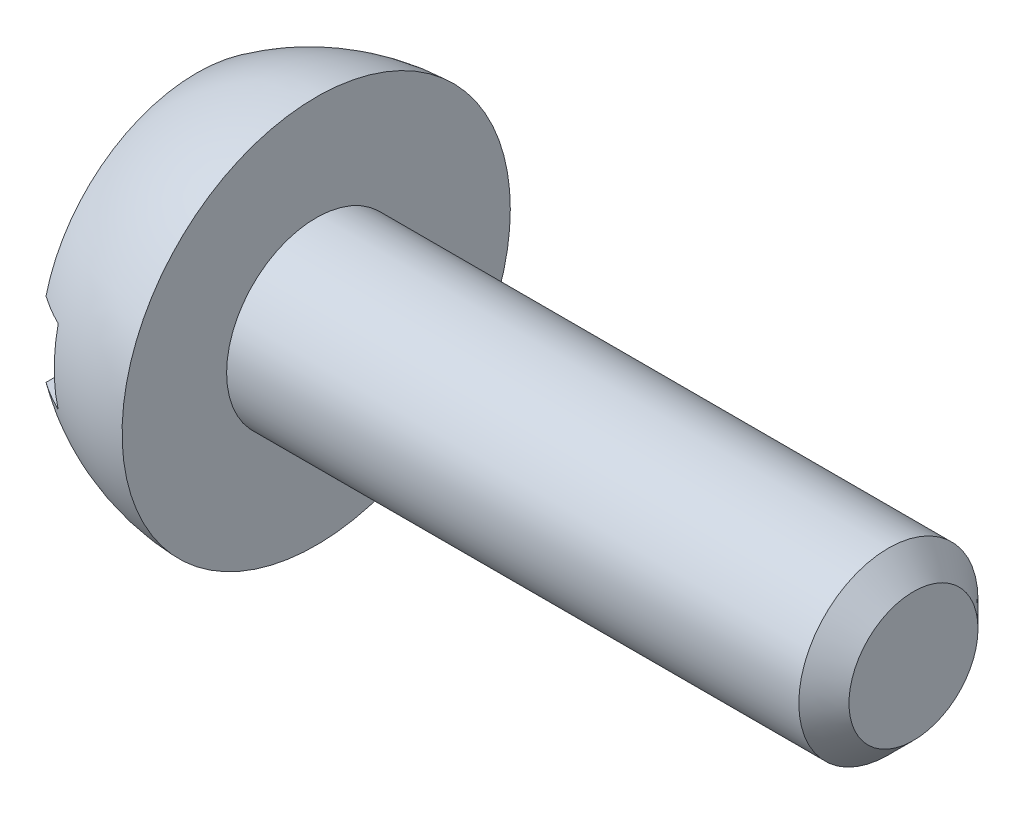
ISO-10303-21;
HEADER;
FILE_DESCRIPTION(('STEP AP214'),'2;1');
FILE_NAME('part.step','',(''),(''),'','','');
FILE_SCHEMA(('AUTOMOTIVE_DESIGN { 1 0 10303 214 1 1 1 1 }'));
ENDSEC;
DATA;
#1=APPLICATION_CONTEXT('core data for automotive mechanical design processes');
#2=APPLICATION_PROTOCOL_DEFINITION('international standard','automotive_design',2000,#1);
#3=PRODUCT_CONTEXT('',#1,'mechanical');
#4=PRODUCT('Part','Part','',(#3));
#5=PRODUCT_RELATED_PRODUCT_CATEGORY('part','',(#4));
#6=PRODUCT_DEFINITION_FORMATION('','',#4);
#7=PRODUCT_DEFINITION_CONTEXT('part definition',#1,'design');
#8=PRODUCT_DEFINITION('design','',#6,#7);
#9=PRODUCT_DEFINITION_SHAPE('','',#8);
#10=(LENGTH_UNIT() NAMED_UNIT(*) SI_UNIT(.MILLI.,.METRE.));
#11=(NAMED_UNIT(*) PLANE_ANGLE_UNIT() SI_UNIT($,.RADIAN.));
#12=(NAMED_UNIT(*) SI_UNIT($,.STERADIAN.) SOLID_ANGLE_UNIT());
#13=UNCERTAINTY_MEASURE_WITH_UNIT(LENGTH_MEASURE(1.E-05),#10,'distance_accuracy_value','');
#14=(GEOMETRIC_REPRESENTATION_CONTEXT(3) GLOBAL_UNCERTAINTY_ASSIGNED_CONTEXT((#13)) GLOBAL_UNIT_ASSIGNED_CONTEXT((#10,
#11,#12)) REPRESENTATION_CONTEXT('',''));
#15=CARTESIAN_POINT('',(0.,0.,0.));
#16=DIRECTION('',(0.,0.,1.));
#17=DIRECTION('',(1.,0.,0.));
#18=AXIS2_PLACEMENT_3D('',#15,#16,#17);
#19=CARTESIAN_POINT('',(0.0225151400772453,0.,0.));
#20=DIRECTION('',(1.,0.,0.));
#21=DIRECTION('',(0.,0.,-1.));
#22=AXIS2_PLACEMENT_3D('',#19,#20,#21);
#23=DEGENERATE_TOROIDAL_SURFACE('',#22,0.0996619694684413,0.750000000000001,.F.);
#24=CARTESIAN_POINT('',(0.,0.,0.));
#25=DIRECTION('',(1.,0.,0.));
#26=DIRECTION('',(0.,0.,-1.));
#27=AXIS2_PLACEMENT_3D('',#24,#25,#26);
#28=CIRCLE('',#27,0.65);
#29=CARTESIAN_POINT('',(0.,0.,-0.65));
#30=VERTEX_POINT('',#29);
#31=EDGE_CURVE('E142',#30,#30,#28,.F.);
#32=ORIENTED_EDGE('',*,*,#31,.T.);
#33=EDGE_LOOP('',(#32));
#34=FACE_BOUND('',#33,.T.);
#35=CARTESIAN_POINT('',(-0.3,0.,0.));
#36=DIRECTION('',(1.,0.,0.));
#37=DIRECTION('',(0.,0.,-1.));
#38=AXIS2_PLACEMENT_3D('',#35,#36,#37);
#39=CIRCLE('',#38,0.577452484978483);
#40=CARTESIAN_POINT('',(-0.3,0.125,0.563760917772619));
#41=VERTEX_POINT('',#40);
#42=CARTESIAN_POINT('',(-0.3,-0.125,0.563760917772619));
#43=VERTEX_POINT('',#42);
#44=EDGE_CURVE('E110',#41,#43,#39,.T.);
#45=ORIENTED_EDGE('',*,*,#44,.T.);
#46=CARTESIAN_POINT('',(-0.3,-0.125,0.563760917772619));
#47=CARTESIAN_POINT('',(-0.304631080707557,-0.124999998211668,0.561501534707431));
#48=CARTESIAN_POINT('',(-0.309238373809965,-0.124999999619542,0.559193396977852));
#49=CARTESIAN_POINT('',(-0.31832452412634,-0.125000009172219,0.554521172330793));
#50=CARTESIAN_POINT('',(-0.322804227402496,-0.125000017200727,0.552158730639608));
#51=CARTESIAN_POINT('',(-0.331635870182839,-0.125000040049112,0.547383755265721));
#52=CARTESIAN_POINT('',(-0.335988673995928,-0.125000054747768,0.544972820077659));
#53=CARTESIAN_POINT('',(-0.344567361991802,-0.125000082970635,0.540106572392637));
#54=CARTESIAN_POINT('',(-0.348794126591955,-0.125000096511087,0.53765281187659));
#55=CARTESIAN_POINT('',(-0.357121734225697,-0.125000114226031,0.532706468770877));
#56=CARTESIAN_POINT('',(-0.361223471828923,-0.125000118565574,0.530215392173125));
#57=CARTESIAN_POINT('',(-0.369302168361253,-0.125000113414877,0.525199815020613));
#58=CARTESIAN_POINT('',(-0.373280034087809,-0.125000104177869,0.522676774972304));
#59=CARTESIAN_POINT('',(-0.381112262195754,-0.125000073829636,0.517602507456649));
#60=CARTESIAN_POINT('',(-0.3849675417739,-0.125000052944311,0.515052695617535));
#61=CARTESIAN_POINT('',(-0.392555998788748,-0.125000017656831,0.50992996583906));
#62=CARTESIAN_POINT('',(-0.396290101986044,-0.125000003138479,0.507358419163328));
#63=CARTESIAN_POINT('',(-0.399999999999998,-0.124999999999999,0.50475241455589));
#64=B_SPLINE_CURVE_WITH_KNOTS('',3,(#46,#47,#48,#49,#50,#51,#52,#53,#54,#55,#56,#57,#58,#59,#60,
#61,#62,#63),.UNSPECIFIED.,.F.,.F.,(4,2,2,2,2,2,2,2,4),(0.,0.0154582186616745,
0.0306505490189183,0.0455771981912502,0.0602383612324944,0.0746342220186075,0.0887649543050084,
0.102630722949918,0.116231685301101),.UNSPECIFIED.);
#65=CARTESIAN_POINT('',(-0.399999999999999,-0.125,0.504752414555891));
#66=VERTEX_POINT('',#65);
#67=EDGE_CURVE('E100',#43,#66,#64,.T.);
#68=ORIENTED_EDGE('',*,*,#67,.T.);
#69=CARTESIAN_POINT('',(-0.399999999999998,0.,0.));
#70=DIRECTION('',(1.,0.,0.));
#71=DIRECTION('',(0.,0.,-1.));
#72=AXIS2_PLACEMENT_3D('',#69,#70,#71);
#73=CIRCLE('',#72,0.520000000000001);
#74=CARTESIAN_POINT('',(-0.399999999999999,-0.125,-0.504752414555889));
#75=VERTEX_POINT('',#74);
#76=EDGE_CURVE('E87',#66,#75,#73,.T.);
#77=ORIENTED_EDGE('',*,*,#76,.T.);
#78=CARTESIAN_POINT('',(-0.4,-0.125,-0.504752414555889));
#79=CARTESIAN_POINT('',(-0.396290101985752,-0.12500000313848,-0.507358419163533));
#80=CARTESIAN_POINT('',(-0.392555998788159,-0.125000017656829,-0.509929965839466));
#81=CARTESIAN_POINT('',(-0.384967541772794,-0.125000052944299,-0.515052695618276));
#82=CARTESIAN_POINT('',(-0.381112262194431,-0.125000073829618,-0.517602507457524));
#83=CARTESIAN_POINT('',(-0.37328003408613,-0.125000104177836,-0.522676774973386));
#84=CARTESIAN_POINT('',(-0.369302168359438,-0.125000113414836,-0.525199815021767));
#85=CARTESIAN_POINT('',(-0.361223471826919,-0.125000118565517,-0.530215392174365));
#86=CARTESIAN_POINT('',(-0.357121734223642,-0.125000114225967,-0.532706468772132));
#87=CARTESIAN_POINT('',(-0.348794126589884,-0.12500009651101,-0.537652811877819));
#88=CARTESIAN_POINT('',(-0.344567361989768,-0.125000082970555,-0.540106572393828));
#89=CARTESIAN_POINT('',(-0.335988673994057,-0.125000054747683,-0.544972820078722));
#90=CARTESIAN_POINT('',(-0.331635870181095,-0.125000040049028,-0.547383755266697));
#91=CARTESIAN_POINT('',(-0.3228042274011,-0.125000017200653,-0.552158730640365));
#92=CARTESIAN_POINT('',(-0.318324524125165,-0.125000009172153,-0.55452117233142));
#93=CARTESIAN_POINT('',(-0.309238373809328,-0.124999999619503,-0.55919339697818));
#94=CARTESIAN_POINT('',(-0.304631080707237,-0.124999998211647,-0.561501534707592));
#95=CARTESIAN_POINT('',(-0.3,-0.125,-0.563760917772618));
#96=B_SPLINE_CURVE_WITH_KNOTS('',3,(#78,#79,#80,#81,#82,#83,#84,#85,#86,#87,#88,#89,#90,#91,#92,
#93,#94,#95),.UNSPECIFIED.,.F.,.F.,(4,2,2,2,2,2,2,2,4),(0.,0.0136009623522593,
0.0274667309979378,0.0415974632848006,0.0559933240710683,0.0706544871121593,0.0855811362840305,
0.100773466640506,0.116231685301105),.UNSPECIFIED.);
#97=CARTESIAN_POINT('',(-0.3,-0.125,-0.563760917772618));
#98=VERTEX_POINT('',#97);
#99=EDGE_CURVE('E58',#75,#98,#96,.T.);
#100=ORIENTED_EDGE('',*,*,#99,.T.);
#101=CARTESIAN_POINT('',(-0.300000000000031,0.125000000000014,-0.5637609177726));
#102=VERTEX_POINT('',#101);
#103=EDGE_CURVE('E97',#98,#102,#39,.T.);
#104=ORIENTED_EDGE('',*,*,#103,.T.);
#105=CARTESIAN_POINT('',(-0.300000000000062,0.125000000000028,-0.563760917772582));
#106=CARTESIAN_POINT('',(-0.304631080707548,0.12499999821169,-0.561501534707431));
#107=CARTESIAN_POINT('',(-0.309238373809885,0.124999999619557,-0.559193396977889));
#108=CARTESIAN_POINT('',(-0.318324524126139,0.125000009172224,-0.554521172330897));
#109=CARTESIAN_POINT('',(-0.322804227402244,0.125000017200727,-0.552158730639741));
#110=CARTESIAN_POINT('',(-0.331635870182507,0.125000040049107,-0.547383755265905));
#111=CARTESIAN_POINT('',(-0.335988673995566,0.125000054747761,-0.544972820077863));
#112=CARTESIAN_POINT('',(-0.3445673619914,0.125000082970626,-0.540106572392871));
#113=CARTESIAN_POINT('',(-0.348794126591542,0.125000096511077,-0.537652811876833));
#114=CARTESIAN_POINT('',(-0.357121734225283,0.125000114226022,-0.532706468771129));
#115=CARTESIAN_POINT('',(-0.361223471828517,0.125000118565565,-0.530215392173376));
#116=CARTESIAN_POINT('',(-0.369302168360883,0.12500011341487,-0.525199815020848));
#117=CARTESIAN_POINT('',(-0.373280034087466,0.125000104177863,-0.522676774972525));
#118=CARTESIAN_POINT('',(-0.381112262195483,0.125000073829633,-0.517602507456828));
#119=CARTESIAN_POINT('',(-0.384967541773673,0.125000052944309,-0.515052695617687));
#120=CARTESIAN_POINT('',(-0.392555998788627,0.12500001765683,-0.509929965839143));
#121=CARTESIAN_POINT('',(-0.396290101985985,0.125000003138479,-0.507358419163369));
#122=CARTESIAN_POINT('',(-0.4,0.125,-0.504752414555889));
#123=B_SPLINE_CURVE_WITH_KNOTS('',3,(#105,#106,#107,#108,#109,#110,#111,#112,#113,#114,#115,
#116,#117,#118,#119,#120,#121,#122),.UNSPECIFIED.,.F.,.F.,(4,2,2,2,2,2,2,2,4),(0.,
0.0154582186614339,0.0306505490185034,0.0455771981907271,0.0602383612319295,0.0746342220180672,
0.0887649543045586,0.102630722949625,0.116231685301031),.UNSPECIFIED.);
#124=CARTESIAN_POINT('',(-0.4,0.125,-0.504752414555889));
#125=VERTEX_POINT('',#124);
#126=EDGE_CURVE('E136',#102,#125,#123,.T.);
#127=ORIENTED_EDGE('',*,*,#126,.T.);
#128=CARTESIAN_POINT('',(-0.4,0.,0.));
#129=DIRECTION('',(1.,0.,0.));
#130=DIRECTION('',(0.,0.,-1.));
#131=AXIS2_PLACEMENT_3D('',#128,#129,#130);
#132=CIRCLE('',#131,0.52);
#133=CARTESIAN_POINT('',(-0.4,0.125,0.504752414555889));
#134=VERTEX_POINT('',#133);
#135=EDGE_CURVE('E141',#125,#134,#132,.T.);
#136=ORIENTED_EDGE('',*,*,#135,.T.);
#137=CARTESIAN_POINT('',(-0.4,0.125,0.504752414555889));
#138=CARTESIAN_POINT('',(-0.396290101985752,0.12500000313848,0.507358419163533));
#139=CARTESIAN_POINT('',(-0.392555998788159,0.125000017656829,0.509929965839466));
#140=CARTESIAN_POINT('',(-0.384967541772795,0.125000052944299,0.515052695618275));
#141=CARTESIAN_POINT('',(-0.381112262194431,0.125000073829618,0.517602507457524));
#142=CARTESIAN_POINT('',(-0.37328003408613,0.125000104177836,0.522676774973386));
#143=CARTESIAN_POINT('',(-0.369302168359438,0.125000113414836,0.525199815021767));
#144=CARTESIAN_POINT('',(-0.361223471826919,0.125000118565517,0.530215392174365));
#145=CARTESIAN_POINT('',(-0.357121734223642,0.125000114225967,0.532706468772131));
#146=CARTESIAN_POINT('',(-0.348794126589884,0.12500009651101,0.537652811877819));
#147=CARTESIAN_POINT('',(-0.344567361989768,0.125000082970555,0.540106572393828));
#148=CARTESIAN_POINT('',(-0.335988673994057,0.125000054747683,0.544972820078722));
#149=CARTESIAN_POINT('',(-0.331635870181095,0.125000040049029,0.547383755266697));
#150=CARTESIAN_POINT('',(-0.3228042274011,0.125000017200652,0.552158730640365));
#151=CARTESIAN_POINT('',(-0.318324524125165,0.125000009172153,0.554521172331421));
#152=CARTESIAN_POINT('',(-0.309238373809328,0.124999999619502,0.55919339697818));
#153=CARTESIAN_POINT('',(-0.304631080707237,0.124999998211645,0.561501534707593));
#154=CARTESIAN_POINT('',(-0.3,0.125,0.563760917772618));
#155=B_SPLINE_CURVE_WITH_KNOTS('',3,(#137,#138,#139,#140,#141,#142,#143,#144,#145,#146,#147,
#148,#149,#150,#151,#152,#153,#154),.UNSPECIFIED.,.F.,.F.,(4,2,2,2,2,2,2,2,4),(0.,
0.0136009623522592,0.0274667309979378,0.0415974632848005,0.0559933240710683,0.0706544871121594,
0.0855811362840305,0.100773466640506,0.116231685301105),.UNSPECIFIED.);
#156=EDGE_CURVE('E66',#134,#41,#155,.T.);
#157=ORIENTED_EDGE('',*,*,#156,.T.);
#158=EDGE_LOOP('',(#45,#68,#77,#100,#104,#127,#136,#157));
#159=FACE_BOUND('',#158,.T.);
#160=ADVANCED_FACE('F44',(#34,#159),#23,.F.);
#161=CARTESIAN_POINT('',(-0.4,0.,0.));
#162=DIRECTION('',(1.,0.,0.));
#163=DIRECTION('',(0.,0.,-1.));
#164=AXIS2_PLACEMENT_3D('',#161,#162,#163);
#165=PLANE('',#164);
#166=DIRECTION('',(0.,0.,-1.));
#167=VECTOR('',#166,1.);
#168=CARTESIAN_POINT('',(-0.4,0.125,1.3));
#169=LINE('',#168,#167);
#170=EDGE_CURVE('E121',#134,#125,#169,.T.);
#171=ORIENTED_EDGE('',*,*,#170,.F.);
#172=ORIENTED_EDGE('',*,*,#135,.F.);
#173=EDGE_LOOP('',(#171,#172));
#174=FACE_BOUND('',#173,.T.);
#175=ADVANCED_FACE('F189',(#174),#165,.F.);
#176=CARTESIAN_POINT('',(0.,0.65,0.));
#177=DIRECTION('',(-1.,0.,0.));
#178=DIRECTION('',(0.,0.,1.));
#179=AXIS2_PLACEMENT_3D('',#176,#177,#178);
#180=PLANE('',#179);
#181=CARTESIAN_POINT('',(0.,0.,0.));
#182=DIRECTION('',(-1.,0.,0.));
#183=DIRECTION('',(0.,0.,1.));
#184=AXIS2_PLACEMENT_3D('',#181,#182,#183);
#185=CIRCLE('',#184,0.3);
#186=CARTESIAN_POINT('',(0.,0.,0.3));
#187=VERTEX_POINT('',#186);
#188=EDGE_CURVE('E151',#187,#187,#185,.F.);
#189=ORIENTED_EDGE('',*,*,#188,.F.);
#190=EDGE_LOOP('',(#189));
#191=FACE_BOUND('',#190,.T.);
#192=ORIENTED_EDGE('',*,*,#31,.F.);
#193=EDGE_LOOP('',(#192));
#194=FACE_BOUND('',#193,.T.);
#195=ADVANCED_FACE('F133',(#191,#194),#180,.F.);
#196=CARTESIAN_POINT('',(-0.3,0.125,1.3));
#197=DIRECTION('',(0.,-1.,0.));
#198=DIRECTION('',(0.,0.,-1.));
#199=AXIS2_PLACEMENT_3D('',#196,#197,#198);
#200=PLANE('',#199);
#201=DIRECTION('',(0.,0.,1.));
#202=VECTOR('',#201,1.);
#203=CARTESIAN_POINT('',(-0.3,0.125,1.3));
#204=LINE('',#203,#202);
#205=EDGE_CURVE('E113',#41,#102,#204,.F.);
#206=ORIENTED_EDGE('',*,*,#205,.F.);
#207=ORIENTED_EDGE('',*,*,#156,.F.);
#208=ORIENTED_EDGE('',*,*,#170,.T.);
#209=ORIENTED_EDGE('',*,*,#126,.F.);
#210=EDGE_LOOP('',(#206,#207,#208,#209));
#211=FACE_BOUND('',#210,.T.);
#212=ADVANCED_FACE('F131',(#211),#200,.T.);
#213=CARTESIAN_POINT('',(-0.3,-0.125,1.3));
#214=DIRECTION('',(-1.,0.,0.));
#215=DIRECTION('',(0.,0.,1.));
#216=AXIS2_PLACEMENT_3D('',#213,#214,#215);
#217=PLANE('',#216);
#218=DIRECTION('',(0.,0.,1.));
#219=VECTOR('',#218,1.);
#220=CARTESIAN_POINT('',(-0.3,-0.125,1.3));
#221=LINE('',#220,#219);
#222=EDGE_CURVE('E91',#98,#43,#221,.T.);
#223=ORIENTED_EDGE('',*,*,#222,.T.);
#224=ORIENTED_EDGE('',*,*,#44,.F.);
#225=ORIENTED_EDGE('',*,*,#205,.T.);
#226=ORIENTED_EDGE('',*,*,#103,.F.);
#227=EDGE_LOOP('',(#223,#224,#225,#226));
#228=FACE_BOUND('',#227,.T.);
#229=ADVANCED_FACE('F207',(#228),#217,.T.);
#230=CARTESIAN_POINT('',(-0.4,0.,0.));
#231=DIRECTION('',(1.,0.,0.));
#232=DIRECTION('',(0.,0.,-1.));
#233=AXIS2_PLACEMENT_3D('',#230,#231,#232);
#234=PLANE('',#233);
#235=ORIENTED_EDGE('',*,*,#76,.F.);
#236=DIRECTION('',(0.,0.,1.));
#237=VECTOR('',#236,1.);
#238=CARTESIAN_POINT('',(-0.4,-0.125,1.3));
#239=LINE('',#238,#237);
#240=EDGE_CURVE('E85',#75,#66,#239,.T.);
#241=ORIENTED_EDGE('',*,*,#240,.F.);
#242=EDGE_LOOP('',(#235,#241));
#243=FACE_BOUND('',#242,.T.);
#244=ADVANCED_FACE('F86',(#243),#234,.F.);
#245=CARTESIAN_POINT('',(-0.5,-0.125,1.3));
#246=DIRECTION('',(0.,1.,0.));
#247=DIRECTION('',(0.,0.,1.));
#248=AXIS2_PLACEMENT_3D('',#245,#246,#247);
#249=PLANE('',#248);
#250=ORIENTED_EDGE('',*,*,#222,.F.);
#251=ORIENTED_EDGE('',*,*,#99,.F.);
#252=ORIENTED_EDGE('',*,*,#240,.T.);
#253=ORIENTED_EDGE('',*,*,#67,.F.);
#254=EDGE_LOOP('',(#250,#251,#252,#253));
#255=FACE_BOUND('',#254,.T.);
#256=ADVANCED_FACE('F93',(#255),#249,.T.);
#257=CARTESIAN_POINT('',(2.,0.,0.));
#258=DIRECTION('',(-1.,0.,0.));
#259=DIRECTION('',(0.,0.,1.));
#260=AXIS2_PLACEMENT_3D('',#257,#258,#259);
#261=CYLINDRICAL_SURFACE('',#260,0.3);
#262=CARTESIAN_POINT('',(1.91599999997835,0.,0.));
#263=DIRECTION('',(1.,0.,0.));
#264=DIRECTION('',(0.,0.,-1.));
#265=AXIS2_PLACEMENT_3D('',#262,#263,#264);
#266=CIRCLE('',#265,0.3);
#267=CARTESIAN_POINT('',(1.91599999997835,0.,-0.3));
#268=VERTEX_POINT('',#267);
#269=EDGE_CURVE('E12',#268,#268,#266,.F.);
#270=ORIENTED_EDGE('',*,*,#269,.T.);
#271=EDGE_LOOP('',(#270));
#272=FACE_BOUND('',#271,.T.);
#273=ORIENTED_EDGE('',*,*,#188,.T.);
#274=EDGE_LOOP('',(#273));
#275=FACE_BOUND('',#274,.T.);
#276=ADVANCED_FACE('F269',(#272,#275),#261,.T.);
#277=CARTESIAN_POINT('',(2.,0.,0.));
#278=DIRECTION('',(1.,0.,0.));
#279=DIRECTION('',(0.,0.,-1.));
#280=AXIS2_PLACEMENT_3D('',#277,#278,#279);
#281=PLANE('',#280);
#282=CARTESIAN_POINT('',(2.,0.,0.));
#283=DIRECTION('',(1.,0.,0.));
#284=DIRECTION('',(0.,0.,-1.));
#285=AXIS2_PLACEMENT_3D('',#282,#283,#284);
#286=CIRCLE('',#285,0.215999999978348);
#287=CARTESIAN_POINT('',(2.,0.,-0.215999999978348));
#288=VERTEX_POINT('',#287);
#289=EDGE_CURVE('E51',#288,#288,#286,.T.);
#290=ORIENTED_EDGE('',*,*,#289,.T.);
#291=EDGE_LOOP('',(#290));
#292=FACE_BOUND('',#291,.T.);
#293=ADVANCED_FACE('F273',(#292),#281,.T.);
#294=CARTESIAN_POINT('',(2.,0.,0.));
#295=DIRECTION('',(-1.,0.,0.));
#296=DIRECTION('',(0.,0.,1.));
#297=AXIS2_PLACEMENT_3D('',#294,#295,#296);
#298=CONICAL_SURFACE('',#297,0.215999999978348,0.785398163397445);
#299=ORIENTED_EDGE('',*,*,#269,.F.);
#300=EDGE_LOOP('',(#299));
#301=FACE_BOUND('',#300,.T.);
#302=ORIENTED_EDGE('',*,*,#289,.F.);
#303=EDGE_LOOP('',(#302));
#304=FACE_BOUND('',#303,.T.);
#305=ADVANCED_FACE('F46',(#301,#304),#298,.T.);
#306=CLOSED_SHELL('',(#160,#175,#195,#212,#229,#244,#256,#276,#293,#305));
#307=MANIFOLD_SOLID_BREP('B2',#306);
#308=ADVANCED_BREP_SHAPE_REPRESENTATION('',(#18,#307),#14);
#309=SHAPE_DEFINITION_REPRESENTATION(#9,#308);
ENDSEC;
END-ISO-10303-21;
